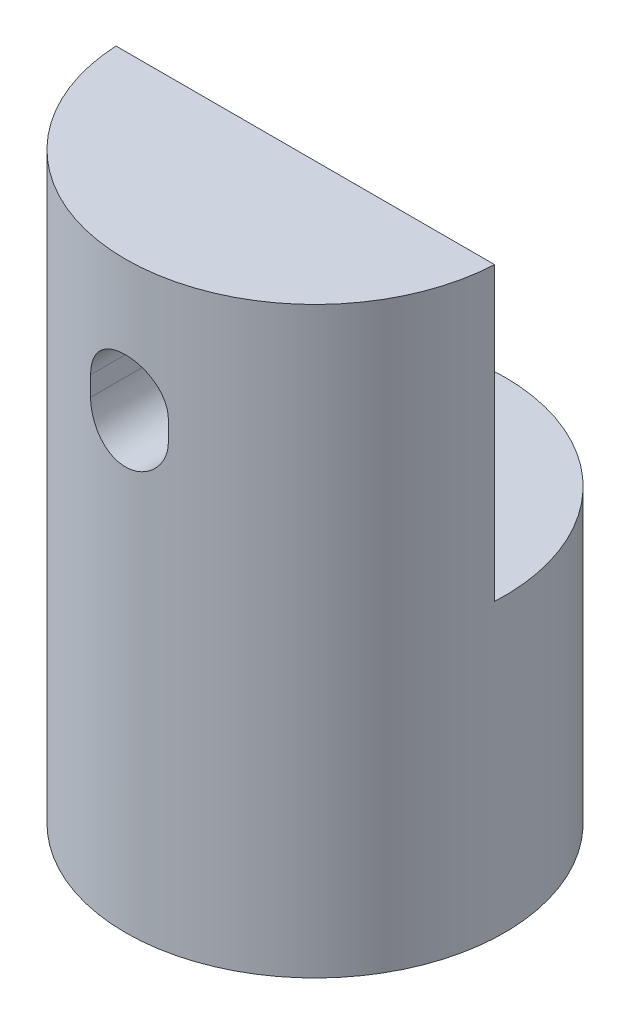
ISO-10303-21;
HEADER;
FILE_DESCRIPTION(('STEP AP214'),'2;1');
FILE_NAME('part.step','',(''),(''),'','','');
FILE_SCHEMA(('AUTOMOTIVE_DESIGN { 1 0 10303 214 1 1 1 1 }'));
ENDSEC;
DATA;
#1=APPLICATION_CONTEXT('core data for automotive mechanical design processes');
#2=APPLICATION_PROTOCOL_DEFINITION('international standard','automotive_design',2000,#1);
#3=PRODUCT_CONTEXT('',#1,'mechanical');
#4=PRODUCT('Part','Part','',(#3));
#5=PRODUCT_RELATED_PRODUCT_CATEGORY('part','',(#4));
#6=PRODUCT_DEFINITION_FORMATION('','',#4);
#7=PRODUCT_DEFINITION_CONTEXT('part definition',#1,'design');
#8=PRODUCT_DEFINITION('design','',#6,#7);
#9=PRODUCT_DEFINITION_SHAPE('','',#8);
#10=(LENGTH_UNIT() NAMED_UNIT(*) SI_UNIT(.MILLI.,.METRE.));
#11=(NAMED_UNIT(*) PLANE_ANGLE_UNIT() SI_UNIT($,.RADIAN.));
#12=(NAMED_UNIT(*) SI_UNIT($,.STERADIAN.) SOLID_ANGLE_UNIT());
#13=UNCERTAINTY_MEASURE_WITH_UNIT(LENGTH_MEASURE(1.E-05),#10,'distance_accuracy_value','');
#14=(GEOMETRIC_REPRESENTATION_CONTEXT(3) GLOBAL_UNCERTAINTY_ASSIGNED_CONTEXT((#13)) GLOBAL_UNIT_ASSIGNED_CONTEXT((#10,
#11,#12)) REPRESENTATION_CONTEXT('',''));
#15=CARTESIAN_POINT('',(0.,0.,0.));
#16=DIRECTION('',(0.,0.,1.));
#17=DIRECTION('',(1.,0.,0.));
#18=AXIS2_PLACEMENT_3D('',#15,#16,#17);
#19=CARTESIAN_POINT('',(0.,30.,0.));
#20=DIRECTION('',(0.,-1.,0.));
#21=DIRECTION('',(0.,0.,-1.));
#22=AXIS2_PLACEMENT_3D('',#19,#20,#21);
#23=CYLINDRICAL_SURFACE('',#22,9.75);
#24=DIRECTION('',(0.,-1.,0.));
#25=VECTOR('',#24,1.);
#26=CARTESIAN_POINT('',(-2.,30.,9.54266734199616));
#27=LINE('',#26,#25);
#28=CARTESIAN_POINT('',(-2.,22.7438436319264,9.54266734199616));
#29=VERTEX_POINT('',#28);
#30=CARTESIAN_POINT('',(-2.,23.7438436319264,9.54266734199616));
#31=VERTEX_POINT('',#30);
#32=EDGE_CURVE('E137',#29,#31,#27,.F.);
#33=ORIENTED_EDGE('',*,*,#32,.T.);
#34=CARTESIAN_POINT('',(-2.,23.7438436319264,9.54266734199616));
#35=CARTESIAN_POINT('',(-2.00000033195727,23.7994793630634,9.5426643982027));
#36=CARTESIAN_POINT('',(-1.99767702666204,23.8550878426235,9.54315451315303));
#37=CARTESIAN_POINT('',(-1.98841304306774,23.9658950188319,9.54509019303102));
#38=CARTESIAN_POINT('',(-1.98147295468331,24.0210937669232,9.54653563589043));
#39=CARTESIAN_POINT('',(-1.95381669603285,24.1852954287999,9.55224981402789));
#40=CARTESIAN_POINT('',(-1.92626418887362,24.2931796841032,9.55789669531187));
#41=CARTESIAN_POINT('',(-1.85377860158542,24.5026652560274,9.57221769271409));
#42=CARTESIAN_POINT('',(-1.80884392767693,24.6042659955184,9.58089208641931));
#43=CARTESIAN_POINT('',(-1.70290763509925,24.7985194277682,9.60028621312603));
#44=CARTESIAN_POINT('',(-1.64190410511583,24.8911710542795,9.61100618939804));
#45=CARTESIAN_POINT('',(-1.504608207634,25.0662251923261,9.63345952765668));
#46=CARTESIAN_POINT('',(-1.42812441180611,25.1484760445532,9.6452044115621));
#47=CARTESIAN_POINT('',(-1.2624441880193,25.2990829411599,9.668284154878));
#48=CARTESIAN_POINT('',(-1.17324578953672,25.3674368277804,9.67961895039047));
#49=CARTESIAN_POINT('',(-0.983658076808378,25.4888950788565,9.70072589191819));
#50=CARTESIAN_POINT('',(-0.883173593293971,25.5418537724663,9.71048274619588));
#51=CARTESIAN_POINT('',(-0.674504258590885,25.6300755723128,9.72720332284191));
#52=CARTESIAN_POINT('',(-0.566320583698461,25.6653413751021,9.73416747081081));
#53=CARTESIAN_POINT('',(-0.346906026968159,25.716703296443,9.74443667907364));
#54=CARTESIAN_POINT('',(-0.235737945932371,25.7330576833091,9.74779099286922));
#55=CARTESIAN_POINT('',(-0.0121861370464904,25.7469388933922,9.75063288317846));
#56=CARTESIAN_POINT('',(0.100197495242987,25.7444671860341,9.75012076147732));
#57=CARTESIAN_POINT('',(0.321208504393304,25.720960607316,9.74532536139086));
#58=CARTESIAN_POINT('',(0.429866932694968,25.7002044466992,9.741098706085));
#59=CARTESIAN_POINT('',(0.64212417501848,25.6411609387801,9.72941323034665));
#60=CARTESIAN_POINT('',(0.745722816926219,25.6028729955743,9.72195430004992));
#61=CARTESIAN_POINT('',(0.945711530400804,25.5095970745948,9.70454951363927));
#62=CARTESIAN_POINT('',(1.04204953461623,25.4545005859038,9.69458757484484));
#63=CARTESIAN_POINT('',(1.22421237467819,25.3292535703137,9.67327387050857));
#64=CARTESIAN_POINT('',(1.31003626980481,25.2591016979202,9.66192198078627));
#65=CARTESIAN_POINT('',(1.47038321597203,25.1042196728302,9.63883629572564));
#66=CARTESIAN_POINT('',(1.54467197934343,25.0192472791765,9.62709931030617));
#67=CARTESIAN_POINT('',(1.67800421092741,24.8379036732713,9.60475858699016));
#68=CARTESIAN_POINT('',(1.7370434702227,24.7415293247182,9.59415516243272));
#69=CARTESIAN_POINT('',(1.83828981219496,24.5397554604599,9.5752734155098));
#70=CARTESIAN_POINT('',(1.88044761952427,24.4343305992779,9.56700192032345));
#71=CARTESIAN_POINT('',(1.94632425721492,24.2177522615906,9.55381963480182));
#72=CARTESIAN_POINT('',(1.97007054952134,24.1066075816586,9.54890384053998));
#73=CARTESIAN_POINT('',(1.98950029451879,23.952779726742,9.54486276489151));
#74=CARTESIAN_POINT('',(1.99343899023821,23.9110575706209,9.54404041804553));
#75=CARTESIAN_POINT('',(1.9986855730404,23.8275111231811,9.54294314424949));
#76=CARTESIAN_POINT('',(1.99999785528823,23.7856871199596,9.54266730275922));
#77=CARTESIAN_POINT('',(2.,23.7438436319264,9.54266734199616));
#78=B_SPLINE_CURVE_WITH_KNOTS('',3,(#34,#35,#36,#37,#38,#39,#40,#41,#42,#43,#44,#45,#46,#47,#48,
#49,#50,#51,#52,#53,#54,#55,#56,#57,#58,#59,#60,#61,#62,#63,#64,#65,#66,#67,#68,#69,#70,#71,#72,
#73,#74,#75,#76,#77),.UNSPECIFIED.,.F.,.F.,(4,2,2,2,2,2,2,2,2,2,2,2,2,2,2,2,2,2,2,2,2,4),(0.,
0.16680276179422,0.333584214271043,0.666330062929224,0.999106428454594,1.33192239403827,
1.66913749036593,2.00640490561241,2.34676679858364,2.68707680163022,3.02268224698209,
3.35826149773899,3.68881233275344,4.01937440399224,4.35211733806081,4.68489002164445,
5.02372341251758,5.36265022291913,5.70255924053864,6.04196028167651,6.16764092502366,
6.29311107196569),.UNSPECIFIED.);
#79=CARTESIAN_POINT('',(2.,23.7438436319264,9.54266734199616));
#80=VERTEX_POINT('',#79);
#81=EDGE_CURVE('E151',#31,#80,#78,.T.);
#82=ORIENTED_EDGE('',*,*,#81,.T.);
#83=DIRECTION('',(0.,-1.,0.));
#84=VECTOR('',#83,1.);
#85=CARTESIAN_POINT('',(2.,30.,9.54266734199616));
#86=LINE('',#85,#84);
#87=CARTESIAN_POINT('',(2.,22.7438436319264,9.54266734199616));
#88=VERTEX_POINT('',#87);
#89=EDGE_CURVE('E123',#80,#88,#86,.T.);
#90=ORIENTED_EDGE('',*,*,#89,.T.);
#91=CARTESIAN_POINT('',(2.,22.7438436319264,9.54266734199616));
#92=CARTESIAN_POINT('',(2.00000033195727,22.6882079007893,9.5426643982027));
#93=CARTESIAN_POINT('',(1.99767702666204,22.6325994212293,9.54315451315303));
#94=CARTESIAN_POINT('',(1.98841304306774,22.5217922450208,9.54509019303102));
#95=CARTESIAN_POINT('',(1.98147295468331,22.4665934969295,9.54653563589043));
#96=CARTESIAN_POINT('',(1.95381669603285,22.3023918350528,9.55224981402789));
#97=CARTESIAN_POINT('',(1.92626418887362,22.1945075797495,9.55789669531187));
#98=CARTESIAN_POINT('',(1.85377860158543,21.9850220078254,9.57221769271409));
#99=CARTESIAN_POINT('',(1.80884392767693,21.8834212683343,9.58089208641931));
#100=CARTESIAN_POINT('',(1.70290763509925,21.6891678360845,9.60028621312603));
#101=CARTESIAN_POINT('',(1.64190410511583,21.5965162095732,9.61100618939804));
#102=CARTESIAN_POINT('',(1.504608207634,21.4214620715266,9.63345952765668));
#103=CARTESIAN_POINT('',(1.42812441180611,21.3392112192996,9.6452044115621));
#104=CARTESIAN_POINT('',(1.2624441880193,21.1886043226928,9.668284154878));
#105=CARTESIAN_POINT('',(1.17324578953672,21.1202504360723,9.67961895039047));
#106=CARTESIAN_POINT('',(0.983658076808379,20.9987921849962,9.70072589191819));
#107=CARTESIAN_POINT('',(0.883173593293971,20.9458334913864,9.71048274619588));
#108=CARTESIAN_POINT('',(0.674504258590885,20.85761169154,9.72720332284191));
#109=CARTESIAN_POINT('',(0.566320583698461,20.8223458887506,9.73416747081081));
#110=CARTESIAN_POINT('',(0.34690602696816,20.7709839674097,9.74443667907364));
#111=CARTESIAN_POINT('',(0.235737945932372,20.7546295805436,9.74779099286922));
#112=CARTESIAN_POINT('',(0.012186137046491,20.7407483704605,9.75063288317846));
#113=CARTESIAN_POINT('',(-0.100197495242987,20.7432200778187,9.75012076147732));
#114=CARTESIAN_POINT('',(-0.321208504393304,20.7667266565368,9.74532536139086));
#115=CARTESIAN_POINT('',(-0.429866932694967,20.7874828171536,9.741098706085));
#116=CARTESIAN_POINT('',(-0.64212417501848,20.8465263250726,9.72941323034665));
#117=CARTESIAN_POINT('',(-0.745722816926218,20.8848142682784,9.72195430004992));
#118=CARTESIAN_POINT('',(-0.945711530400803,20.9780901892579,9.70454951363927));
#119=CARTESIAN_POINT('',(-1.04204953461623,21.033186677949,9.69458757484484));
#120=CARTESIAN_POINT('',(-1.22421237467819,21.158433693539,9.67327387050857));
#121=CARTESIAN_POINT('',(-1.31003626980481,21.2285855659325,9.66192198078627));
#122=CARTESIAN_POINT('',(-1.47038321597203,21.3834675910225,9.63883629572564));
#123=CARTESIAN_POINT('',(-1.54467197934343,21.4684399846762,9.62709931030617));
#124=CARTESIAN_POINT('',(-1.67800421092741,21.6497835905815,9.60475858699016));
#125=CARTESIAN_POINT('',(-1.7370434702227,21.7461579391345,9.59415516243272));
#126=CARTESIAN_POINT('',(-1.83828981219496,21.9479318033928,9.5752734155098));
#127=CARTESIAN_POINT('',(-1.88044761952427,22.0533566645749,9.56700192032345));
#128=CARTESIAN_POINT('',(-1.94632425721492,22.2699350022621,9.55381963480182));
#129=CARTESIAN_POINT('',(-1.97007054952134,22.3810796821941,9.54890384053998));
#130=CARTESIAN_POINT('',(-1.98950029451879,22.5349075371107,9.54486276489151));
#131=CARTESIAN_POINT('',(-1.99343899023821,22.5766296932319,9.54404041804553));
#132=CARTESIAN_POINT('',(-1.9986855730404,22.6601761406717,9.54294314424949));
#133=CARTESIAN_POINT('',(-1.99999785528823,22.7020001438931,9.54266730275922));
#134=CARTESIAN_POINT('',(-2.,22.7438436319264,9.54266734199616));
#135=B_SPLINE_CURVE_WITH_KNOTS('',3,(#91,#92,#93,#94,#95,#96,#97,#98,#99,#100,#101,#102,#103,
#104,#105,#106,#107,#108,#109,#110,#111,#112,#113,#114,#115,#116,#117,#118,#119,#120,#121,#122,
#123,#124,#125,#126,#127,#128,#129,#130,#131,#132,#133,#134),.UNSPECIFIED.,.F.,.F.,(4,2,2,2,2,2,
2,2,2,2,2,2,2,2,2,2,2,2,2,2,2,4),(0.,0.16680276179422,0.333584214271043,0.666330062929224,
0.999106428454594,1.33192239403827,1.66913749036593,2.00640490561241,2.34676679858364,
2.68707680163022,3.02268224698209,3.35826149773899,3.68881233275344,4.01937440399224,
4.35211733806081,4.68489002164445,5.02372341251758,5.36265022291913,5.70255924053864,
6.04196028167651,6.16764092502366,6.29311107196569),.UNSPECIFIED.);
#136=EDGE_CURVE('E98',#88,#29,#135,.T.);
#137=ORIENTED_EDGE('',*,*,#136,.T.);
#138=EDGE_LOOP('',(#33,#82,#90,#137));
#139=FACE_BOUND('',#138,.T.);
#140=CARTESIAN_POINT('',(0.,0.,0.));
#141=DIRECTION('',(0.,1.,0.));
#142=DIRECTION('',(0.,0.,1.));
#143=AXIS2_PLACEMENT_3D('',#140,#141,#142);
#144=CIRCLE('',#143,9.75);
#145=CARTESIAN_POINT('',(0.,0.,9.75));
#146=VERTEX_POINT('',#145);
#147=EDGE_CURVE('E171',#146,#146,#144,.T.);
#148=ORIENTED_EDGE('',*,*,#147,.T.);
#149=EDGE_LOOP('',(#148));
#150=FACE_BOUND('',#149,.T.);
#151=DIRECTION('',(0.,-1.,0.));
#152=VECTOR('',#151,1.);
#153=CARTESIAN_POINT('',(-9.73717104707522,30.,0.5));
#154=LINE('',#153,#152);
#155=CARTESIAN_POINT('',(-9.73717104707522,30.,0.5));
#156=VERTEX_POINT('',#155);
#157=CARTESIAN_POINT('',(-9.73717104707522,15.,0.5));
#158=VERTEX_POINT('',#157);
#159=EDGE_CURVE('E167',#156,#158,#154,.T.);
#160=ORIENTED_EDGE('',*,*,#159,.T.);
#161=CARTESIAN_POINT('',(0.,15.,0.));
#162=DIRECTION('',(0.,1.,0.));
#163=DIRECTION('',(-1.,0.,0.));
#164=AXIS2_PLACEMENT_3D('',#161,#162,#163);
#165=CIRCLE('',#164,9.75);
#166=CARTESIAN_POINT('',(9.73717104707522,15.,0.5));
#167=VERTEX_POINT('',#166);
#168=EDGE_CURVE('E11',#167,#158,#165,.T.);
#169=ORIENTED_EDGE('',*,*,#168,.F.);
#170=DIRECTION('',(0.,-1.,0.));
#171=VECTOR('',#170,1.);
#172=CARTESIAN_POINT('',(9.73717104707522,30.,0.5));
#173=LINE('',#172,#171);
#174=CARTESIAN_POINT('',(9.73717104707522,30.,0.5));
#175=VERTEX_POINT('',#174);
#176=EDGE_CURVE('E163',#167,#175,#173,.F.);
#177=ORIENTED_EDGE('',*,*,#176,.T.);
#178=CARTESIAN_POINT('',(0.,30.,0.));
#179=DIRECTION('',(0.,1.,0.));
#180=DIRECTION('',(0.,0.,1.));
#181=AXIS2_PLACEMENT_3D('',#178,#179,#180);
#182=CIRCLE('',#181,9.75);
#183=EDGE_CURVE('E172',#156,#175,#182,.T.);
#184=ORIENTED_EDGE('',*,*,#183,.F.);
#185=EDGE_LOOP('',(#160,#169,#177,#184));
#186=FACE_BOUND('',#185,.T.);
#187=ADVANCED_FACE('F39',(#139,#150,#186),#23,.T.);
#188=CARTESIAN_POINT('',(0.,30.,0.));
#189=DIRECTION('',(0.,1.,0.));
#190=DIRECTION('',(0.,0.,1.));
#191=AXIS2_PLACEMENT_3D('',#188,#189,#190);
#192=PLANE('',#191);
#193=DIRECTION('',(1.,0.,0.));
#194=VECTOR('',#193,1.);
#195=CARTESIAN_POINT('',(0.,30.,0.5));
#196=LINE('',#195,#194);
#197=EDGE_CURVE('E48',#156,#175,#196,.T.);
#198=ORIENTED_EDGE('',*,*,#197,.F.);
#199=ORIENTED_EDGE('',*,*,#183,.T.);
#200=EDGE_LOOP('',(#198,#199));
#201=FACE_BOUND('',#200,.T.);
#202=ADVANCED_FACE('F185',(#201),#192,.T.);
#203=CARTESIAN_POINT('',(0.,0.,0.));
#204=DIRECTION('',(0.,1.,0.));
#205=DIRECTION('',(0.,0.,1.));
#206=AXIS2_PLACEMENT_3D('',#203,#204,#205);
#207=PLANE('',#206);
#208=ORIENTED_EDGE('',*,*,#147,.F.);
#209=EDGE_LOOP('',(#208));
#210=FACE_BOUND('',#209,.T.);
#211=ADVANCED_FACE('F187',(#210),#207,.F.);
#212=CARTESIAN_POINT('',(-9.75,15.,0.5));
#213=DIRECTION('',(0.,1.,0.));
#214=DIRECTION('',(-1.,0.,0.));
#215=AXIS2_PLACEMENT_3D('',#212,#213,#214);
#216=PLANE('',#215);
#217=ORIENTED_EDGE('',*,*,#168,.T.);
#218=DIRECTION('',(1.,0.,0.));
#219=VECTOR('',#218,1.);
#220=CARTESIAN_POINT('',(-9.75,15.,0.5));
#221=LINE('',#220,#219);
#222=EDGE_CURVE('E159',#158,#167,#221,.T.);
#223=ORIENTED_EDGE('',*,*,#222,.T.);
#224=EDGE_LOOP('',(#217,#223));
#225=FACE_BOUND('',#224,.T.);
#226=ADVANCED_FACE('F193',(#225),#216,.T.);
#227=CARTESIAN_POINT('',(0.,0.,0.5));
#228=DIRECTION('',(0.,0.,1.));
#229=DIRECTION('',(1.,0.,0.));
#230=AXIS2_PLACEMENT_3D('',#227,#228,#229);
#231=PLANE('',#230);
#232=DIRECTION('',(0.,-1.,0.));
#233=VECTOR('',#232,1.);
#234=CARTESIAN_POINT('',(2.,23.7438436319264,0.5));
#235=LINE('',#234,#233);
#236=CARTESIAN_POINT('',(2.,23.7438436319264,0.5));
#237=VERTEX_POINT('',#236);
#238=CARTESIAN_POINT('',(2.,22.7438436319264,0.5));
#239=VERTEX_POINT('',#238);
#240=EDGE_CURVE('E105',#237,#239,#235,.T.);
#241=ORIENTED_EDGE('',*,*,#240,.F.);
#242=CARTESIAN_POINT('',(0.,23.7438436319264,0.5));
#243=DIRECTION('',(0.,0.,-1.));
#244=DIRECTION('',(-1.,0.,0.));
#245=AXIS2_PLACEMENT_3D('',#242,#243,#244);
#246=CIRCLE('',#245,2.);
#247=CARTESIAN_POINT('',(-2.,23.7438436319264,0.5));
#248=VERTEX_POINT('',#247);
#249=EDGE_CURVE('E63',#248,#237,#246,.T.);
#250=ORIENTED_EDGE('',*,*,#249,.F.);
#251=DIRECTION('',(0.,1.,0.));
#252=VECTOR('',#251,1.);
#253=CARTESIAN_POINT('',(-2.,23.7438436319264,0.5));
#254=LINE('',#253,#252);
#255=CARTESIAN_POINT('',(-2.,22.7438436319264,0.5));
#256=VERTEX_POINT('',#255);
#257=EDGE_CURVE('E113',#256,#248,#254,.T.);
#258=ORIENTED_EDGE('',*,*,#257,.F.);
#259=CARTESIAN_POINT('',(0.,22.7438436319264,0.5));
#260=DIRECTION('',(0.,0.,-1.));
#261=DIRECTION('',(-1.,0.,0.));
#262=AXIS2_PLACEMENT_3D('',#259,#260,#261);
#263=CIRCLE('',#262,2.);
#264=EDGE_CURVE('E95',#239,#256,#263,.T.);
#265=ORIENTED_EDGE('',*,*,#264,.F.);
#266=EDGE_LOOP('',(#241,#250,#258,#265));
#267=FACE_BOUND('',#266,.T.);
#268=ORIENTED_EDGE('',*,*,#197,.T.);
#269=ORIENTED_EDGE('',*,*,#176,.F.);
#270=ORIENTED_EDGE('',*,*,#222,.F.);
#271=ORIENTED_EDGE('',*,*,#159,.F.);
#272=EDGE_LOOP('',(#268,#269,#270,#271));
#273=FACE_BOUND('',#272,.T.);
#274=ADVANCED_FACE('F110',(#267,#273),#231,.F.);
#275=CARTESIAN_POINT('',(0.,23.7438436319264,30.5));
#276=DIRECTION('',(0.,0.,-1.));
#277=DIRECTION('',(-1.,0.,0.));
#278=AXIS2_PLACEMENT_3D('',#275,#276,#277);
#279=CYLINDRICAL_SURFACE('',#278,2.);
#280=DIRECTION('',(0.,0.,-1.));
#281=VECTOR('',#280,1.);
#282=CARTESIAN_POINT('',(-2.,23.7438436319264,30.5));
#283=LINE('',#282,#281);
#284=EDGE_CURVE('E120',#31,#248,#283,.T.);
#285=ORIENTED_EDGE('',*,*,#284,.T.);
#286=ORIENTED_EDGE('',*,*,#249,.T.);
#287=DIRECTION('',(0.,0.,-1.));
#288=VECTOR('',#287,1.);
#289=CARTESIAN_POINT('',(2.,23.7438436319264,30.5));
#290=LINE('',#289,#288);
#291=EDGE_CURVE('E102',#80,#237,#290,.T.);
#292=ORIENTED_EDGE('',*,*,#291,.F.);
#293=ORIENTED_EDGE('',*,*,#81,.F.);
#294=EDGE_LOOP('',(#285,#286,#292,#293));
#295=FACE_BOUND('',#294,.T.);
#296=ADVANCED_FACE('F146',(#295),#279,.F.);
#297=CARTESIAN_POINT('',(-2.,23.7438436319264,30.5));
#298=DIRECTION('',(-1.,0.,0.));
#299=DIRECTION('',(0.,0.,1.));
#300=AXIS2_PLACEMENT_3D('',#297,#298,#299);
#301=PLANE('',#300);
#302=DIRECTION('',(0.,0.,-1.));
#303=VECTOR('',#302,1.);
#304=CARTESIAN_POINT('',(-2.,22.7438436319264,30.5));
#305=LINE('',#304,#303);
#306=EDGE_CURVE('E101',#29,#256,#305,.T.);
#307=ORIENTED_EDGE('',*,*,#306,.T.);
#308=ORIENTED_EDGE('',*,*,#257,.T.);
#309=ORIENTED_EDGE('',*,*,#284,.F.);
#310=ORIENTED_EDGE('',*,*,#32,.F.);
#311=EDGE_LOOP('',(#307,#308,#309,#310));
#312=FACE_BOUND('',#311,.T.);
#313=ADVANCED_FACE('F143',(#312),#301,.F.);
#314=CARTESIAN_POINT('',(0.,22.7438436319264,30.5));
#315=DIRECTION('',(0.,0.,-1.));
#316=DIRECTION('',(-1.,0.,0.));
#317=AXIS2_PLACEMENT_3D('',#314,#315,#316);
#318=CYLINDRICAL_SURFACE('',#317,2.);
#319=DIRECTION('',(0.,0.,-1.));
#320=VECTOR('',#319,1.);
#321=CARTESIAN_POINT('',(2.,22.7438436319264,30.5));
#322=LINE('',#321,#320);
#323=EDGE_CURVE('E55',#88,#239,#322,.T.);
#324=ORIENTED_EDGE('',*,*,#323,.T.);
#325=ORIENTED_EDGE('',*,*,#264,.T.);
#326=ORIENTED_EDGE('',*,*,#306,.F.);
#327=ORIENTED_EDGE('',*,*,#136,.F.);
#328=EDGE_LOOP('',(#324,#325,#326,#327));
#329=FACE_BOUND('',#328,.T.);
#330=ADVANCED_FACE('F92',(#329),#318,.F.);
#331=CARTESIAN_POINT('',(2.,23.7438436319264,30.5));
#332=DIRECTION('',(1.,0.,0.));
#333=DIRECTION('',(0.,0.,-1.));
#334=AXIS2_PLACEMENT_3D('',#331,#332,#333);
#335=PLANE('',#334);
#336=ORIENTED_EDGE('',*,*,#291,.T.);
#337=ORIENTED_EDGE('',*,*,#240,.T.);
#338=ORIENTED_EDGE('',*,*,#323,.F.);
#339=ORIENTED_EDGE('',*,*,#89,.F.);
#340=EDGE_LOOP('',(#336,#337,#338,#339));
#341=FACE_BOUND('',#340,.T.);
#342=ADVANCED_FACE('F106',(#341),#335,.F.);
#343=CLOSED_SHELL('',(#187,#202,#211,#226,#274,#296,#313,#330,#342));
#344=MANIFOLD_SOLID_BREP('B2',#343);
#345=ADVANCED_BREP_SHAPE_REPRESENTATION('',(#18,#344),#14);
#346=SHAPE_DEFINITION_REPRESENTATION(#9,#345);
ENDSEC;
END-ISO-10303-21;
